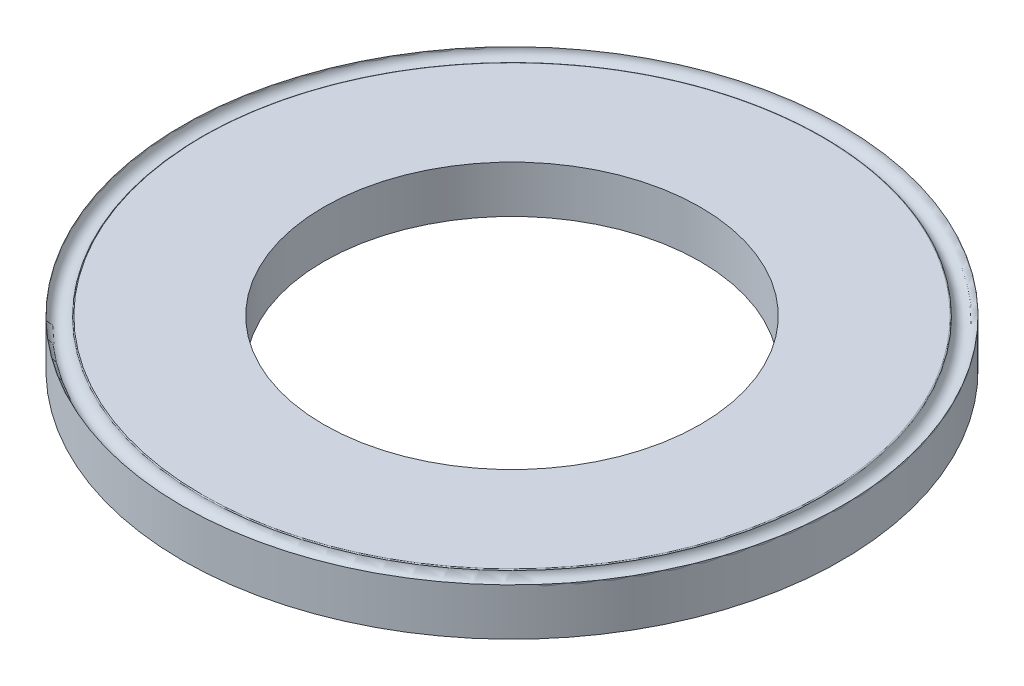
ISO-10303-21;
HEADER;
FILE_DESCRIPTION(('STEP AP214'),'2;1');
FILE_NAME('part.step','',(''),(''),'','','');
FILE_SCHEMA(('AUTOMOTIVE_DESIGN { 1 0 10303 214 1 1 1 1 }'));
ENDSEC;
DATA;
#1=APPLICATION_CONTEXT('core data for automotive mechanical design processes');
#2=APPLICATION_PROTOCOL_DEFINITION('international standard','automotive_design',2000,#1);
#3=PRODUCT_CONTEXT('',#1,'mechanical');
#4=PRODUCT('Part','Part','',(#3));
#5=PRODUCT_RELATED_PRODUCT_CATEGORY('part','',(#4));
#6=PRODUCT_DEFINITION_FORMATION('','',#4);
#7=PRODUCT_DEFINITION_CONTEXT('part definition',#1,'design');
#8=PRODUCT_DEFINITION('design','',#6,#7);
#9=PRODUCT_DEFINITION_SHAPE('','',#8);
#10=(LENGTH_UNIT() NAMED_UNIT(*) SI_UNIT(.MILLI.,.METRE.));
#11=(NAMED_UNIT(*) PLANE_ANGLE_UNIT() SI_UNIT($,.RADIAN.));
#12=(NAMED_UNIT(*) SI_UNIT($,.STERADIAN.) SOLID_ANGLE_UNIT());
#13=UNCERTAINTY_MEASURE_WITH_UNIT(LENGTH_MEASURE(1.E-05),#10,'distance_accuracy_value','');
#14=(GEOMETRIC_REPRESENTATION_CONTEXT(3) GLOBAL_UNCERTAINTY_ASSIGNED_CONTEXT((#13)) GLOBAL_UNIT_ASSIGNED_CONTEXT((#10,
#11,#12)) REPRESENTATION_CONTEXT('',''));
#15=CARTESIAN_POINT('',(0.,0.,0.));
#16=DIRECTION('',(0.,0.,1.));
#17=DIRECTION('',(1.,0.,0.));
#18=AXIS2_PLACEMENT_3D('',#15,#16,#17);
#19=CARTESIAN_POINT('',(0.,0.25,0.));
#20=DIRECTION('',(0.,1.,0.));
#21=DIRECTION('',(0.,0.,1.));
#22=AXIS2_PLACEMENT_3D('',#19,#20,#21);
#23=PLANE('',#22);
#24=CARTESIAN_POINT('',(0.,0.25,0.));
#25=DIRECTION('',(0.,1.,0.));
#26=DIRECTION('',(0.,0.,1.));
#27=AXIS2_PLACEMENT_3D('',#24,#25,#26);
#28=CIRCLE('',#27,3.29045548849897);
#29=CARTESIAN_POINT('',(0.,0.25,3.29045548849897));
#30=VERTEX_POINT('',#29);
#31=EDGE_CURVE('E63',#30,#30,#28,.T.);
#32=ORIENTED_EDGE('',*,*,#31,.T.);
#33=EDGE_LOOP('',(#32));
#34=FACE_BOUND('',#33,.T.);
#35=CARTESIAN_POINT('',(0.,0.25,0.));
#36=DIRECTION('',(0.,1.,0.));
#37=DIRECTION('',(0.,0.,1.));
#38=AXIS2_PLACEMENT_3D('',#35,#36,#37);
#39=CIRCLE('',#38,2.);
#40=CARTESIAN_POINT('',(0.,0.25,2.));
#41=VERTEX_POINT('',#40);
#42=EDGE_CURVE('E42',#41,#41,#39,.T.);
#43=ORIENTED_EDGE('',*,*,#42,.F.);
#44=EDGE_LOOP('',(#43));
#45=FACE_BOUND('',#44,.T.);
#46=ADVANCED_FACE('F34',(#34,#45),#23,.T.);
#47=CARTESIAN_POINT('',(0.,-0.25,0.));
#48=DIRECTION('',(0.,1.,0.));
#49=DIRECTION('',(0.,0.,1.));
#50=AXIS2_PLACEMENT_3D('',#47,#48,#49);
#51=PLANE('',#50);
#52=CARTESIAN_POINT('',(0.,-0.25,0.));
#53=DIRECTION('',(0.,1.,0.));
#54=DIRECTION('',(0.,0.,1.));
#55=AXIS2_PLACEMENT_3D('',#52,#53,#54);
#56=CIRCLE('',#55,3.5);
#57=CARTESIAN_POINT('',(0.,-0.25,3.5));
#58=VERTEX_POINT('',#57);
#59=EDGE_CURVE('E10',#58,#58,#56,.T.);
#60=ORIENTED_EDGE('',*,*,#59,.F.);
#61=EDGE_LOOP('',(#60));
#62=FACE_BOUND('',#61,.T.);
#63=CARTESIAN_POINT('',(0.,-0.25,0.));
#64=DIRECTION('',(0.,1.,0.));
#65=DIRECTION('',(0.,0.,1.));
#66=AXIS2_PLACEMENT_3D('',#63,#64,#65);
#67=CIRCLE('',#66,2.);
#68=CARTESIAN_POINT('',(0.,-0.25,2.));
#69=VERTEX_POINT('',#68);
#70=EDGE_CURVE('E48',#69,#69,#67,.T.);
#71=ORIENTED_EDGE('',*,*,#70,.T.);
#72=EDGE_LOOP('',(#71));
#73=FACE_BOUND('',#72,.T.);
#74=ADVANCED_FACE('F83',(#62,#73),#51,.F.);
#75=CARTESIAN_POINT('',(0.,0.25,0.));
#76=DIRECTION('',(0.,-1.,0.));
#77=DIRECTION('',(0.,0.,-1.));
#78=AXIS2_PLACEMENT_3D('',#75,#76,#77);
#79=CYLINDRICAL_SURFACE('',#78,3.5);
#80=CARTESIAN_POINT('',(0.,0.25,0.));
#81=DIRECTION('',(0.,1.,0.));
#82=DIRECTION('',(0.,0.,1.));
#83=AXIS2_PLACEMENT_3D('',#80,#81,#82);
#84=CIRCLE('',#83,3.5);
#85=CARTESIAN_POINT('',(0.,0.25,3.5));
#86=VERTEX_POINT('',#85);
#87=EDGE_CURVE('E59',#86,#86,#84,.T.);
#88=ORIENTED_EDGE('',*,*,#87,.F.);
#89=EDGE_LOOP('',(#88));
#90=FACE_BOUND('',#89,.T.);
#91=ORIENTED_EDGE('',*,*,#59,.T.);
#92=EDGE_LOOP('',(#91));
#93=FACE_BOUND('',#92,.T.);
#94=ADVANCED_FACE('F36',(#90,#93),#79,.T.);
#95=CARTESIAN_POINT('',(0.,0.25,0.));
#96=DIRECTION('',(0.,-1.,0.));
#97=DIRECTION('',(0.,0.,-1.));
#98=AXIS2_PLACEMENT_3D('',#95,#96,#97);
#99=CYLINDRICAL_SURFACE('',#98,2.);
#100=ORIENTED_EDGE('',*,*,#42,.T.);
#101=EDGE_LOOP('',(#100));
#102=FACE_BOUND('',#101,.T.);
#103=ORIENTED_EDGE('',*,*,#70,.F.);
#104=EDGE_LOOP('',(#103));
#105=FACE_BOUND('',#104,.T.);
#106=ADVANCED_FACE('F73',(#102,#105),#99,.F.);
#107=CARTESIAN_POINT('',(0.,0.24,0.));
#108=DIRECTION('',(0.,1.,0.));
#109=DIRECTION('',(0.,0.,1.));
#110=AXIS2_PLACEMENT_3D('',#107,#108,#109);
#111=TOROIDAL_SURFACE('',#110,3.29045548849897,0.01);
#112=ORIENTED_EDGE('',*,*,#31,.F.);
#113=EDGE_LOOP('',(#112));
#114=FACE_BOUND('',#113,.T.);
#115=CARTESIAN_POINT('',(0.,0.240909090909091,0.));
#116=DIRECTION('',(0.,1.,0.));
#117=DIRECTION('',(0.,0.,1.));
#118=AXIS2_PLACEMENT_3D('',#115,#116,#117);
#119=CIRCLE('',#118,3.30041408045361);
#120=CARTESIAN_POINT('',(0.,0.240909090909091,3.30041408045361));
#121=VERTEX_POINT('',#120);
#122=EDGE_CURVE('E54',#121,#121,#119,.T.);
#123=ORIENTED_EDGE('',*,*,#122,.T.);
#124=EDGE_LOOP('',(#123));
#125=FACE_BOUND('',#124,.T.);
#126=ADVANCED_FACE('F69',(#114,#125),#111,.T.);
#127=CARTESIAN_POINT('',(0.,0.25,0.));
#128=DIRECTION('',(0.,1.,0.));
#129=DIRECTION('',(0.,0.,1.));
#130=AXIS2_PLACEMENT_3D('',#127,#128,#129);
#131=TOROIDAL_SURFACE('',#130,3.4,0.0999999999999996);
#132=ORIENTED_EDGE('',*,*,#122,.F.);
#133=EDGE_LOOP('',(#132));
#134=FACE_BOUND('',#133,.T.);
#135=ORIENTED_EDGE('',*,*,#87,.T.);
#136=EDGE_LOOP('',(#135));
#137=FACE_BOUND('',#136,.T.);
#138=ADVANCED_FACE('F72',(#134,#137),#131,.F.);
#139=CLOSED_SHELL('',(#46,#74,#94,#106,#126,#138));
#140=MANIFOLD_SOLID_BREP('B2',#139);
#141=ADVANCED_BREP_SHAPE_REPRESENTATION('',(#18,#140),#14);
#142=SHAPE_DEFINITION_REPRESENTATION(#9,#141);
ENDSEC;
END-ISO-10303-21;
